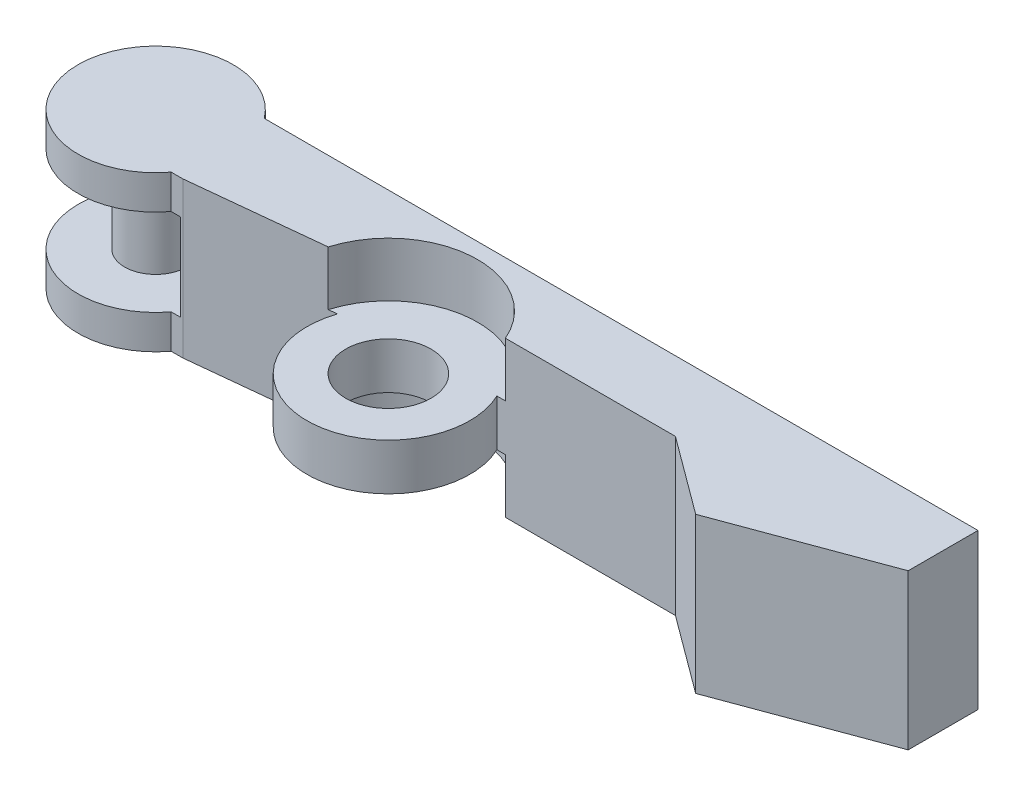
ISO-10303-21;
HEADER;
FILE_DESCRIPTION(('STEP AP214'),'2;1');
FILE_NAME('part.step','',(''),(''),'','','');
FILE_SCHEMA(('AUTOMOTIVE_DESIGN { 1 0 10303 214 1 1 1 1 }'));
ENDSEC;
DATA;
#1=APPLICATION_CONTEXT('core data for automotive mechanical design processes');
#2=APPLICATION_PROTOCOL_DEFINITION('international standard','automotive_design',2000,#1);
#3=PRODUCT_CONTEXT('',#1,'mechanical');
#4=PRODUCT('Part','Part','',(#3));
#5=PRODUCT_RELATED_PRODUCT_CATEGORY('part','',(#4));
#6=PRODUCT_DEFINITION_FORMATION('','',#4);
#7=PRODUCT_DEFINITION_CONTEXT('part definition',#1,'design');
#8=PRODUCT_DEFINITION('design','',#6,#7);
#9=PRODUCT_DEFINITION_SHAPE('','',#8);
#10=(LENGTH_UNIT() NAMED_UNIT(*) SI_UNIT(.MILLI.,.METRE.));
#11=(NAMED_UNIT(*) PLANE_ANGLE_UNIT() SI_UNIT($,.RADIAN.));
#12=(NAMED_UNIT(*) SI_UNIT($,.STERADIAN.) SOLID_ANGLE_UNIT());
#13=UNCERTAINTY_MEASURE_WITH_UNIT(LENGTH_MEASURE(1.E-05),#10,'distance_accuracy_value','');
#14=(GEOMETRIC_REPRESENTATION_CONTEXT(3) GLOBAL_UNCERTAINTY_ASSIGNED_CONTEXT((#13)) GLOBAL_UNIT_ASSIGNED_CONTEXT((#10,
#11,#12)) REPRESENTATION_CONTEXT('',''));
#15=CARTESIAN_POINT('',(0.,0.,0.));
#16=DIRECTION('',(0.,0.,1.));
#17=DIRECTION('',(1.,0.,0.));
#18=AXIS2_PLACEMENT_3D('',#15,#16,#17);
#19=CARTESIAN_POINT('',(-6.25,5.,3.75));
#20=DIRECTION('',(0.,-1.,0.));
#21=DIRECTION('',(0.,0.,-1.));
#22=AXIS2_PLACEMENT_3D('',#19,#20,#21);
#23=CYLINDRICAL_SURFACE('',#22,2.75);
#24=CARTESIAN_POINT('',(-6.25,1.5,3.75));
#25=DIRECTION('',(0.,1.,0.));
#26=DIRECTION('',(0.,0.,1.));
#27=AXIS2_PLACEMENT_3D('',#24,#25,#26);
#28=CIRCLE('',#27,2.75);
#29=CARTESIAN_POINT('',(-6.25,1.5,6.50000000000001));
#30=VERTEX_POINT('',#29);
#31=EDGE_CURVE('E341',#30,#30,#28,.T.);
#32=ORIENTED_EDGE('',*,*,#31,.T.);
#33=EDGE_LOOP('',(#32));
#34=FACE_BOUND('',#33,.T.);
#35=CARTESIAN_POINT('',(-6.25,-1.5,3.75));
#36=DIRECTION('',(0.,-1.,0.));
#37=DIRECTION('',(0.,0.,-1.));
#38=AXIS2_PLACEMENT_3D('',#35,#36,#37);
#39=CIRCLE('',#38,2.75);
#40=CARTESIAN_POINT('',(-6.25,-1.5,1.00000000000001));
#41=VERTEX_POINT('',#40);
#42=EDGE_CURVE('E387',#41,#41,#39,.T.);
#43=ORIENTED_EDGE('',*,*,#42,.T.);
#44=EDGE_LOOP('',(#43));
#45=FACE_BOUND('',#44,.T.);
#46=ADVANCED_FACE('F107',(#34,#45),#23,.F.);
#47=CARTESIAN_POINT('',(-6.25,5.,3.75));
#48=DIRECTION('',(0.,-1.,0.));
#49=DIRECTION('',(0.,0.,-1.));
#50=AXIS2_PLACEMENT_3D('',#47,#48,#49);
#51=CYLINDRICAL_SURFACE('',#50,5.25);
#52=CARTESIAN_POINT('',(-6.25,-1.5,3.75));
#53=DIRECTION('',(0.,-1.,0.));
#54=DIRECTION('',(0.,0.,-1.));
#55=AXIS2_PLACEMENT_3D('',#52,#53,#54);
#56=CIRCLE('',#55,5.25);
#57=CARTESIAN_POINT('',(-1.50658350974743,-1.5,1.49999999999999));
#58=VERTEX_POINT('',#57);
#59=CARTESIAN_POINT('',(-11.2196543991426,-1.5,2.0573585278971));
#60=VERTEX_POINT('',#59);
#61=EDGE_CURVE('E12',#58,#60,#56,.T.);
#62=ORIENTED_EDGE('',*,*,#61,.F.);
#63=DIRECTION('',(0.,-1.,0.));
#64=VECTOR('',#63,1.);
#65=CARTESIAN_POINT('',(-1.50658350974744,5.,1.49999999999999));
#66=LINE('',#65,#64);
#67=CARTESIAN_POINT('',(-1.50658350974743,1.5,1.49999999999999));
#68=VERTEX_POINT('',#67);
#69=EDGE_CURVE('E296',#68,#58,#66,.T.);
#70=ORIENTED_EDGE('',*,*,#69,.F.);
#71=CARTESIAN_POINT('',(-6.25,1.5,3.75));
#72=DIRECTION('',(0.,1.,0.));
#73=DIRECTION('',(0.,0.,1.));
#74=AXIS2_PLACEMENT_3D('',#71,#72,#73);
#75=CIRCLE('',#74,5.25);
#76=CARTESIAN_POINT('',(-11.2196543991426,1.5,2.0573585278971));
#77=VERTEX_POINT('',#76);
#78=EDGE_CURVE('E298',#77,#68,#75,.T.);
#79=ORIENTED_EDGE('',*,*,#78,.F.);
#80=DIRECTION('',(0.,-1.,0.));
#81=VECTOR('',#80,1.);
#82=CARTESIAN_POINT('',(-11.2196543991426,5.,2.0573585278971));
#83=LINE('',#82,#81);
#84=EDGE_CURVE('E274',#77,#60,#83,.T.);
#85=ORIENTED_EDGE('',*,*,#84,.T.);
#86=EDGE_LOOP('',(#62,#70,#79,#85));
#87=FACE_BOUND('',#86,.T.);
#88=ADVANCED_FACE('F109',(#87),#51,.T.);
#89=CARTESIAN_POINT('',(-25.,5.,0.));
#90=DIRECTION('',(0.,-1.,0.));
#91=DIRECTION('',(0.,0.,-1.));
#92=AXIS2_PLACEMENT_3D('',#89,#90,#91);
#93=CYLINDRICAL_SURFACE('',#92,5.);
#94=CARTESIAN_POINT('',(-25.,-2.8,0.));
#95=DIRECTION('',(0.,1.,0.));
#96=DIRECTION('',(0.,0.,1.));
#97=AXIS2_PLACEMENT_3D('',#94,#95,#96);
#98=CIRCLE('',#97,5.);
#99=CARTESIAN_POINT('',(-21.,-2.8,-3.));
#100=VERTEX_POINT('',#99);
#101=CARTESIAN_POINT('',(-21.,-2.8,3.));
#102=VERTEX_POINT('',#101);
#103=EDGE_CURVE('E130',#100,#102,#98,.T.);
#104=ORIENTED_EDGE('',*,*,#103,.F.);
#105=DIRECTION('',(0.,-1.,0.));
#106=VECTOR('',#105,1.);
#107=CARTESIAN_POINT('',(-21.,5.,-3.));
#108=LINE('',#107,#106);
#109=CARTESIAN_POINT('',(-21.,-5.,-3.));
#110=VERTEX_POINT('',#109);
#111=EDGE_CURVE('E284',#100,#110,#108,.T.);
#112=ORIENTED_EDGE('',*,*,#111,.T.);
#113=CARTESIAN_POINT('',(-25.,-5.,0.));
#114=DIRECTION('',(0.,1.,0.));
#115=DIRECTION('',(0.,0.,1.));
#116=AXIS2_PLACEMENT_3D('',#113,#114,#115);
#117=CIRCLE('',#116,5.);
#118=CARTESIAN_POINT('',(-21.,-5.,3.));
#119=VERTEX_POINT('',#118);
#120=EDGE_CURVE('E266',#110,#119,#117,.T.);
#121=ORIENTED_EDGE('',*,*,#120,.T.);
#122=DIRECTION('',(0.,-1.,0.));
#123=VECTOR('',#122,1.);
#124=CARTESIAN_POINT('',(-21.,5.,3.));
#125=LINE('',#124,#123);
#126=EDGE_CURVE('E280',#102,#119,#125,.T.);
#127=ORIENTED_EDGE('',*,*,#126,.F.);
#128=EDGE_LOOP('',(#104,#112,#121,#127));
#129=FACE_BOUND('',#128,.T.);
#130=ADVANCED_FACE('F406',(#129),#93,.T.);
#131=CARTESIAN_POINT('',(0.,5.,1.49999999999999));
#132=DIRECTION('',(0.,0.,-1.));
#133=DIRECTION('',(-1.,0.,0.));
#134=AXIS2_PLACEMENT_3D('',#131,#132,#133);
#135=PLANE('',#134);
#136=DIRECTION('',(-1.,0.,0.));
#137=VECTOR('',#136,1.);
#138=CARTESIAN_POINT('',(0.,-1.5,1.49999999999999));
#139=LINE('',#138,#137);
#140=CARTESIAN_POINT('',(-0.958497377870821,-1.5,1.49999999999999));
#141=VERTEX_POINT('',#140);
#142=EDGE_CURVE('E241',#141,#58,#139,.T.);
#143=ORIENTED_EDGE('',*,*,#142,.F.);
#144=DIRECTION('',(0.,1.,0.));
#145=VECTOR('',#144,1.);
#146=CARTESIAN_POINT('',(-0.958497377870821,-5.,1.49999999999999));
#147=LINE('',#146,#145);
#148=CARTESIAN_POINT('',(-0.958497377870822,-5.,1.49999999999999));
#149=VERTEX_POINT('',#148);
#150=EDGE_CURVE('E226',#141,#149,#147,.F.);
#151=ORIENTED_EDGE('',*,*,#150,.T.);
#152=DIRECTION('',(1.,0.,0.));
#153=VECTOR('',#152,1.);
#154=CARTESIAN_POINT('',(0.,-5.,1.49999999999999));
#155=LINE('',#154,#153);
#156=CARTESIAN_POINT('',(10.,-5.,1.49999999999999));
#157=VERTEX_POINT('',#156);
#158=EDGE_CURVE('E238',#149,#157,#155,.T.);
#159=ORIENTED_EDGE('',*,*,#158,.T.);
#160=DIRECTION('',(0.,-1.,0.));
#161=VECTOR('',#160,1.);
#162=CARTESIAN_POINT('',(10.,5.,1.49999999999999));
#163=LINE('',#162,#161);
#164=CARTESIAN_POINT('',(10.,5.,1.49999999999999));
#165=VERTEX_POINT('',#164);
#166=EDGE_CURVE('E294',#165,#157,#163,.T.);
#167=ORIENTED_EDGE('',*,*,#166,.F.);
#168=DIRECTION('',(1.,0.,0.));
#169=VECTOR('',#168,1.);
#170=CARTESIAN_POINT('',(0.,5.,1.49999999999999));
#171=LINE('',#170,#169);
#172=CARTESIAN_POINT('',(-0.958497377870822,5.,1.49999999999999));
#173=VERTEX_POINT('',#172);
#174=EDGE_CURVE('E273',#173,#165,#171,.T.);
#175=ORIENTED_EDGE('',*,*,#174,.F.);
#176=DIRECTION('',(0.,-1.,0.));
#177=VECTOR('',#176,1.);
#178=CARTESIAN_POINT('',(-0.958497377870821,5.,1.49999999999999));
#179=LINE('',#178,#177);
#180=CARTESIAN_POINT('',(-0.958497377870821,1.5,1.49999999999999));
#181=VERTEX_POINT('',#180);
#182=EDGE_CURVE('E249',#181,#173,#179,.F.);
#183=ORIENTED_EDGE('',*,*,#182,.F.);
#184=DIRECTION('',(1.,0.,0.));
#185=VECTOR('',#184,1.);
#186=CARTESIAN_POINT('',(0.,1.5,1.49999999999999));
#187=LINE('',#186,#185);
#188=EDGE_CURVE('E339',#68,#181,#187,.T.);
#189=ORIENTED_EDGE('',*,*,#188,.F.);
#190=ORIENTED_EDGE('',*,*,#69,.T.);
#191=EDGE_LOOP('',(#143,#151,#159,#167,#175,#183,#189,#190));
#192=FACE_BOUND('',#191,.T.);
#193=ADVANCED_FACE('F236',(#192),#135,.F.);
#194=CARTESIAN_POINT('',(0.0915080643471655,5.,0.876631753191315));
#195=DIRECTION('',(-0.103821868182723,0.,-0.994595907736931));
#196=DIRECTION('',(-0.994595907736931,0.,0.103821868182723));
#197=AXIS2_PLACEMENT_3D('',#194,#195,#196);
#198=PLANE('',#197);
#199=DIRECTION('',(0.994595907736931,0.,-0.103821868182723));
#200=VECTOR('',#199,1.);
#201=CARTESIAN_POINT('',(0.0915080643471655,-5.,0.876631753191315));
#202=LINE('',#201,#200);
#203=CARTESIAN_POINT('',(-20.25,-5.,3.));
#204=VERTEX_POINT('',#203);
#205=CARTESIAN_POINT('',(-11.7623526925942,-5.,2.11400862091219));
#206=VERTEX_POINT('',#205);
#207=EDGE_CURVE('E271',#204,#206,#202,.T.);
#208=ORIENTED_EDGE('',*,*,#207,.T.);
#209=DIRECTION('',(0.,1.,0.));
#210=VECTOR('',#209,1.);
#211=CARTESIAN_POINT('',(-11.7623526925942,-5.,2.11400862091219));
#212=LINE('',#211,#210);
#213=CARTESIAN_POINT('',(-11.7623526925942,-1.5,2.11400862091219));
#214=VERTEX_POINT('',#213);
#215=EDGE_CURVE('E122',#206,#214,#212,.T.);
#216=ORIENTED_EDGE('',*,*,#215,.T.);
#217=DIRECTION('',(-0.994595907736931,0.,0.103821868182723));
#218=VECTOR('',#217,1.);
#219=CARTESIAN_POINT('',(0.0915080643471655,-1.5,0.876631753191315));
#220=LINE('',#219,#218);
#221=EDGE_CURVE('E242',#60,#214,#220,.T.);
#222=ORIENTED_EDGE('',*,*,#221,.F.);
#223=ORIENTED_EDGE('',*,*,#84,.F.);
#224=DIRECTION('',(0.994595907736931,0.,-0.103821868182723));
#225=VECTOR('',#224,1.);
#226=CARTESIAN_POINT('',(0.0915080643471655,1.5,0.876631753191315));
#227=LINE('',#226,#225);
#228=CARTESIAN_POINT('',(-11.7623526925942,1.5,2.11400862091219));
#229=VERTEX_POINT('',#228);
#230=EDGE_CURVE('E335',#229,#77,#227,.T.);
#231=ORIENTED_EDGE('',*,*,#230,.F.);
#232=DIRECTION('',(0.,-1.,0.));
#233=VECTOR('',#232,1.);
#234=CARTESIAN_POINT('',(-11.7623526925942,5.,2.11400862091219));
#235=LINE('',#234,#233);
#236=CARTESIAN_POINT('',(-11.7623526925942,5.,2.11400862091219));
#237=VERTEX_POINT('',#236);
#238=EDGE_CURVE('E253',#237,#229,#235,.T.);
#239=ORIENTED_EDGE('',*,*,#238,.F.);
#240=DIRECTION('',(0.994595907736931,0.,-0.103821868182723));
#241=VECTOR('',#240,1.);
#242=CARTESIAN_POINT('',(0.0915080643471655,5.,0.876631753191315));
#243=LINE('',#242,#241);
#244=CARTESIAN_POINT('',(-20.25,5.,3.));
#245=VERTEX_POINT('',#244);
#246=EDGE_CURVE('E256',#245,#237,#243,.T.);
#247=ORIENTED_EDGE('',*,*,#246,.F.);
#248=DIRECTION('',(0.,-1.,0.));
#249=VECTOR('',#248,1.);
#250=CARTESIAN_POINT('',(-20.25,5.,3.));
#251=LINE('',#250,#249);
#252=EDGE_CURVE('E277',#245,#204,#251,.T.);
#253=ORIENTED_EDGE('',*,*,#252,.T.);
#254=EDGE_LOOP('',(#208,#216,#222,#223,#231,#239,#247,#253));
#255=FACE_BOUND('',#254,.T.);
#256=ADVANCED_FACE('F369',(#255),#198,.F.);
#257=CARTESIAN_POINT('',(2.81604566762027,5.,-3.80991704684196));
#258=DIRECTION('',(-0.594393794424638,0.,0.804174121163744));
#259=DIRECTION('',(0.804174121163744,0.,0.594393794424638));
#260=AXIS2_PLACEMENT_3D('',#257,#258,#259);
#261=PLANE('',#260);
#262=DIRECTION('',(-0.804174121163744,0.,-0.594393794424639));
#263=VECTOR('',#262,1.);
#264=CARTESIAN_POINT('',(2.81604566762027,-5.,-3.80991704684196));
#265=LINE('',#264,#263);
#266=CARTESIAN_POINT('',(15.,-5.,5.19567845309715));
#267=VERTEX_POINT('',#266);
#268=EDGE_CURVE('E248',#267,#157,#265,.T.);
#269=ORIENTED_EDGE('',*,*,#268,.F.);
#270=DIRECTION('',(0.,-1.,0.));
#271=VECTOR('',#270,1.);
#272=CARTESIAN_POINT('',(15.,5.,5.19567845309715));
#273=LINE('',#272,#271);
#274=CARTESIAN_POINT('',(15.,5.,5.19567845309715));
#275=VERTEX_POINT('',#274);
#276=EDGE_CURVE('E292',#275,#267,#273,.T.);
#277=ORIENTED_EDGE('',*,*,#276,.F.);
#278=DIRECTION('',(-0.804174121163744,0.,-0.594393794424639));
#279=VECTOR('',#278,1.);
#280=CARTESIAN_POINT('',(2.81604566762027,5.,-3.80991704684196));
#281=LINE('',#280,#279);
#282=EDGE_CURVE('E346',#275,#165,#281,.T.);
#283=ORIENTED_EDGE('',*,*,#282,.T.);
#284=ORIENTED_EDGE('',*,*,#166,.T.);
#285=EDGE_LOOP('',(#269,#277,#283,#284));
#286=FACE_BOUND('',#285,.T.);
#287=ADVANCED_FACE('F432',(#286),#261,.T.);
#288=CARTESIAN_POINT('',(3.49193211678642,5.,9.44869030437433));
#289=DIRECTION('',(0.346652309635126,0.,0.937993697326711));
#290=DIRECTION('',(0.937993697326711,0.,-0.346652309635126));
#291=AXIS2_PLACEMENT_3D('',#288,#289,#290);
#292=PLANE('',#291);
#293=DIRECTION('',(-0.937993697326711,0.,0.346652309635126));
#294=VECTOR('',#293,1.);
#295=CARTESIAN_POINT('',(3.49193211678642,-5.,9.44869030437433));
#296=LINE('',#295,#294);
#297=CARTESIAN_POINT('',(25.,-5.,1.49999999999999));
#298=VERTEX_POINT('',#297);
#299=EDGE_CURVE('E251',#298,#267,#296,.T.);
#300=ORIENTED_EDGE('',*,*,#299,.F.);
#301=DIRECTION('',(0.,-1.,0.));
#302=VECTOR('',#301,1.);
#303=CARTESIAN_POINT('',(25.,5.,1.49999999999999));
#304=LINE('',#303,#302);
#305=CARTESIAN_POINT('',(25.,5.,1.49999999999999));
#306=VERTEX_POINT('',#305);
#307=EDGE_CURVE('E290',#306,#298,#304,.T.);
#308=ORIENTED_EDGE('',*,*,#307,.F.);
#309=DIRECTION('',(-0.937993697326711,0.,0.346652309635126));
#310=VECTOR('',#309,1.);
#311=CARTESIAN_POINT('',(3.49193211678642,5.,9.44869030437433));
#312=LINE('',#311,#310);
#313=EDGE_CURVE('E349',#306,#275,#312,.T.);
#314=ORIENTED_EDGE('',*,*,#313,.T.);
#315=ORIENTED_EDGE('',*,*,#276,.T.);
#316=EDGE_LOOP('',(#300,#308,#314,#315));
#317=FACE_BOUND('',#316,.T.);
#318=ADVANCED_FACE('F435',(#317),#292,.T.);
#319=CARTESIAN_POINT('',(25.,5.,0.));
#320=DIRECTION('',(1.,0.,0.));
#321=DIRECTION('',(0.,0.,-1.));
#322=AXIS2_PLACEMENT_3D('',#319,#320,#321);
#323=PLANE('',#322);
#324=DIRECTION('',(0.,0.,1.));
#325=VECTOR('',#324,1.);
#326=CARTESIAN_POINT('',(25.,-5.,0.));
#327=LINE('',#326,#325);
#328=CARTESIAN_POINT('',(25.,-5.,-3.00000000000001));
#329=VERTEX_POINT('',#328);
#330=EDGE_CURVE('E260',#329,#298,#327,.T.);
#331=ORIENTED_EDGE('',*,*,#330,.F.);
#332=DIRECTION('',(0.,-1.,0.));
#333=VECTOR('',#332,1.);
#334=CARTESIAN_POINT('',(25.,5.,-3.00000000000001));
#335=LINE('',#334,#333);
#336=CARTESIAN_POINT('',(25.,5.,-3.00000000000001));
#337=VERTEX_POINT('',#336);
#338=EDGE_CURVE('E288',#337,#329,#335,.T.);
#339=ORIENTED_EDGE('',*,*,#338,.F.);
#340=DIRECTION('',(0.,0.,1.));
#341=VECTOR('',#340,1.);
#342=CARTESIAN_POINT('',(25.,5.,0.));
#343=LINE('',#342,#341);
#344=EDGE_CURVE('E352',#337,#306,#343,.T.);
#345=ORIENTED_EDGE('',*,*,#344,.T.);
#346=ORIENTED_EDGE('',*,*,#307,.T.);
#347=EDGE_LOOP('',(#331,#339,#345,#346));
#348=FACE_BOUND('',#347,.T.);
#349=ADVANCED_FACE('F439',(#348),#323,.T.);
#350=CARTESIAN_POINT('',(0.,5.,-3.));
#351=DIRECTION('',(0.,0.,-1.));
#352=DIRECTION('',(-1.,0.,0.));
#353=AXIS2_PLACEMENT_3D('',#350,#351,#352);
#354=PLANE('',#353);
#355=DIRECTION('',(1.,0.,0.));
#356=VECTOR('',#355,1.);
#357=CARTESIAN_POINT('',(0.,2.8,-3.));
#358=LINE('',#357,#356);
#359=CARTESIAN_POINT('',(-21.,2.8,-3.));
#360=VERTEX_POINT('',#359);
#361=CARTESIAN_POINT('',(-20.3902277713536,2.8,-3.));
#362=VERTEX_POINT('',#361);
#363=EDGE_CURVE('E320',#360,#362,#358,.T.);
#364=ORIENTED_EDGE('',*,*,#363,.F.);
#365=CARTESIAN_POINT('',(-21.,5.,-3.));
#366=VERTEX_POINT('',#365);
#367=EDGE_CURVE('E285',#366,#360,#108,.T.);
#368=ORIENTED_EDGE('',*,*,#367,.F.);
#369=DIRECTION('',(1.,0.,0.));
#370=VECTOR('',#369,1.);
#371=CARTESIAN_POINT('',(0.,5.,-3.));
#372=LINE('',#371,#370);
#373=EDGE_CURVE('E355',#366,#337,#372,.T.);
#374=ORIENTED_EDGE('',*,*,#373,.T.);
#375=ORIENTED_EDGE('',*,*,#338,.T.);
#376=DIRECTION('',(1.,0.,0.));
#377=VECTOR('',#376,1.);
#378=CARTESIAN_POINT('',(0.,-5.,-3.));
#379=LINE('',#378,#377);
#380=EDGE_CURVE('E263',#110,#329,#379,.T.);
#381=ORIENTED_EDGE('',*,*,#380,.F.);
#382=ORIENTED_EDGE('',*,*,#111,.F.);
#383=DIRECTION('',(1.,0.,0.));
#384=VECTOR('',#383,1.);
#385=CARTESIAN_POINT('',(0.,-2.8,-3.));
#386=LINE('',#385,#384);
#387=CARTESIAN_POINT('',(-20.3902277713536,-2.8,-3.));
#388=VERTEX_POINT('',#387);
#389=EDGE_CURVE('E326',#100,#388,#386,.T.);
#390=ORIENTED_EDGE('',*,*,#389,.T.);
#391=DIRECTION('',(0.,-1.,0.));
#392=VECTOR('',#391,1.);
#393=CARTESIAN_POINT('',(-20.3902277713536,2.8,-3.));
#394=LINE('',#393,#392);
#395=EDGE_CURVE('E323',#388,#362,#394,.F.);
#396=ORIENTED_EDGE('',*,*,#395,.T.);
#397=EDGE_LOOP('',(#364,#368,#374,#375,#381,#382,#390,#396));
#398=FACE_BOUND('',#397,.T.);
#399=ADVANCED_FACE('F400',(#398),#354,.T.);
#400=ORIENTED_EDGE('',*,*,#367,.T.);
#401=CARTESIAN_POINT('',(-25.,2.8,0.));
#402=DIRECTION('',(0.,1.,0.));
#403=DIRECTION('',(0.,0.,1.));
#404=AXIS2_PLACEMENT_3D('',#401,#402,#403);
#405=CIRCLE('',#404,5.);
#406=CARTESIAN_POINT('',(-21.,2.8,3.));
#407=VERTEX_POINT('',#406);
#408=EDGE_CURVE('E313',#360,#407,#405,.T.);
#409=ORIENTED_EDGE('',*,*,#408,.T.);
#410=CARTESIAN_POINT('',(-21.,5.,3.));
#411=VERTEX_POINT('',#410);
#412=EDGE_CURVE('E281',#411,#407,#125,.T.);
#413=ORIENTED_EDGE('',*,*,#412,.F.);
#414=CARTESIAN_POINT('',(-25.,5.,0.));
#415=DIRECTION('',(0.,1.,0.));
#416=DIRECTION('',(0.,0.,1.));
#417=AXIS2_PLACEMENT_3D('',#414,#415,#416);
#418=CIRCLE('',#417,5.);
#419=EDGE_CURVE('E358',#366,#411,#418,.T.);
#420=ORIENTED_EDGE('',*,*,#419,.F.);
#421=EDGE_LOOP('',(#400,#409,#413,#420));
#422=FACE_BOUND('',#421,.T.);
#423=ADVANCED_FACE('F318',(#422),#93,.T.);
#424=CARTESIAN_POINT('',(0.,5.,2.99999999999999));
#425=DIRECTION('',(0.,0.,-1.));
#426=DIRECTION('',(-1.,0.,0.));
#427=AXIS2_PLACEMENT_3D('',#424,#425,#426);
#428=PLANE('',#427);
#429=ORIENTED_EDGE('',*,*,#412,.T.);
#430=DIRECTION('',(1.,0.,0.));
#431=VECTOR('',#430,1.);
#432=CARTESIAN_POINT('',(0.,2.8,2.99999999999999));
#433=LINE('',#432,#431);
#434=CARTESIAN_POINT('',(-20.3902277713536,2.8,3.));
#435=VERTEX_POINT('',#434);
#436=EDGE_CURVE('E115',#407,#435,#433,.T.);
#437=ORIENTED_EDGE('',*,*,#436,.T.);
#438=DIRECTION('',(0.,-1.,0.));
#439=VECTOR('',#438,1.);
#440=CARTESIAN_POINT('',(-20.3902277713536,2.8,3.));
#441=LINE('',#440,#439);
#442=CARTESIAN_POINT('',(-20.3902277713536,-2.8,3.));
#443=VERTEX_POINT('',#442);
#444=EDGE_CURVE('E302',#443,#435,#441,.F.);
#445=ORIENTED_EDGE('',*,*,#444,.F.);
#446=DIRECTION('',(1.,0.,0.));
#447=VECTOR('',#446,1.);
#448=CARTESIAN_POINT('',(0.,-2.8,2.99999999999999));
#449=LINE('',#448,#447);
#450=EDGE_CURVE('E300',#102,#443,#449,.T.);
#451=ORIENTED_EDGE('',*,*,#450,.F.);
#452=ORIENTED_EDGE('',*,*,#126,.T.);
#453=DIRECTION('',(1.,0.,0.));
#454=VECTOR('',#453,1.);
#455=CARTESIAN_POINT('',(0.,-5.,2.99999999999999));
#456=LINE('',#455,#454);
#457=EDGE_CURVE('E269',#119,#204,#456,.T.);
#458=ORIENTED_EDGE('',*,*,#457,.T.);
#459=ORIENTED_EDGE('',*,*,#252,.F.);
#460=DIRECTION('',(1.,0.,0.));
#461=VECTOR('',#460,1.);
#462=CARTESIAN_POINT('',(0.,5.,2.99999999999999));
#463=LINE('',#462,#461);
#464=EDGE_CURVE('E359',#411,#245,#463,.T.);
#465=ORIENTED_EDGE('',*,*,#464,.F.);
#466=EDGE_LOOP('',(#429,#437,#445,#451,#452,#458,#459,#465));
#467=FACE_BOUND('',#466,.T.);
#468=ADVANCED_FACE('F306',(#467),#428,.F.);
#469=CARTESIAN_POINT('',(0.,-5.,0.));
#470=DIRECTION('',(0.,1.,0.));
#471=DIRECTION('',(0.,0.,1.));
#472=AXIS2_PLACEMENT_3D('',#469,#470,#471);
#473=PLANE('',#472);
#474=ORIENTED_EDGE('',*,*,#158,.F.);
#475=CARTESIAN_POINT('',(-6.25,-5.,3.75));
#476=DIRECTION('',(0.,1.,0.));
#477=DIRECTION('',(0.,0.,1.));
#478=AXIS2_PLACEMENT_3D('',#475,#476,#477);
#479=CIRCLE('',#478,5.75);
#480=EDGE_CURVE('E223',#149,#206,#479,.T.);
#481=ORIENTED_EDGE('',*,*,#480,.T.);
#482=ORIENTED_EDGE('',*,*,#207,.F.);
#483=ORIENTED_EDGE('',*,*,#457,.F.);
#484=ORIENTED_EDGE('',*,*,#120,.F.);
#485=ORIENTED_EDGE('',*,*,#380,.T.);
#486=ORIENTED_EDGE('',*,*,#330,.T.);
#487=ORIENTED_EDGE('',*,*,#299,.T.);
#488=ORIENTED_EDGE('',*,*,#268,.T.);
#489=EDGE_LOOP('',(#474,#481,#482,#483,#484,#485,#486,#487,#488));
#490=FACE_BOUND('',#489,.T.);
#491=ADVANCED_FACE('F245',(#490),#473,.F.);
#492=CARTESIAN_POINT('',(0.,5.,0.));
#493=DIRECTION('',(0.,1.,0.));
#494=DIRECTION('',(0.,0.,1.));
#495=AXIS2_PLACEMENT_3D('',#492,#493,#494);
#496=PLANE('',#495);
#497=ORIENTED_EDGE('',*,*,#246,.T.);
#498=CARTESIAN_POINT('',(-6.25,5.,3.75));
#499=DIRECTION('',(0.,1.,0.));
#500=DIRECTION('',(0.,0.,1.));
#501=AXIS2_PLACEMENT_3D('',#498,#499,#500);
#502=CIRCLE('',#501,5.75);
#503=EDGE_CURVE('E333',#173,#237,#502,.T.);
#504=ORIENTED_EDGE('',*,*,#503,.F.);
#505=ORIENTED_EDGE('',*,*,#174,.T.);
#506=ORIENTED_EDGE('',*,*,#282,.F.);
#507=ORIENTED_EDGE('',*,*,#313,.F.);
#508=ORIENTED_EDGE('',*,*,#344,.F.);
#509=ORIENTED_EDGE('',*,*,#373,.F.);
#510=ORIENTED_EDGE('',*,*,#419,.T.);
#511=ORIENTED_EDGE('',*,*,#464,.T.);
#512=EDGE_LOOP('',(#497,#504,#505,#506,#507,#508,#509,#510,#511));
#513=FACE_BOUND('',#512,.T.);
#514=ADVANCED_FACE('F365',(#513),#496,.T.);
#515=CARTESIAN_POINT('',(-6.25,5.,3.75));
#516=DIRECTION('',(0.,-1.,0.));
#517=DIRECTION('',(0.,0.,-1.));
#518=AXIS2_PLACEMENT_3D('',#515,#516,#517);
#519=CYLINDRICAL_SURFACE('',#518,5.75);
#520=ORIENTED_EDGE('',*,*,#182,.T.);
#521=ORIENTED_EDGE('',*,*,#503,.T.);
#522=ORIENTED_EDGE('',*,*,#238,.T.);
#523=CARTESIAN_POINT('',(-6.25,1.5,3.75));
#524=DIRECTION('',(0.,1.,0.));
#525=DIRECTION('',(0.,0.,1.));
#526=AXIS2_PLACEMENT_3D('',#523,#524,#525);
#527=CIRCLE('',#526,5.75);
#528=EDGE_CURVE('E332',#181,#229,#527,.T.);
#529=ORIENTED_EDGE('',*,*,#528,.F.);
#530=EDGE_LOOP('',(#520,#521,#522,#529));
#531=FACE_BOUND('',#530,.T.);
#532=ADVANCED_FACE('F374',(#531),#519,.F.);
#533=CARTESIAN_POINT('',(-6.25,1.5,3.75));
#534=DIRECTION('',(0.,1.,0.));
#535=DIRECTION('',(0.,0.,1.));
#536=AXIS2_PLACEMENT_3D('',#533,#534,#535);
#537=PLANE('',#536);
#538=ORIENTED_EDGE('',*,*,#31,.F.);
#539=EDGE_LOOP('',(#538));
#540=FACE_BOUND('',#539,.T.);
#541=ORIENTED_EDGE('',*,*,#188,.T.);
#542=ORIENTED_EDGE('',*,*,#528,.T.);
#543=ORIENTED_EDGE('',*,*,#230,.T.);
#544=ORIENTED_EDGE('',*,*,#78,.T.);
#545=EDGE_LOOP('',(#541,#542,#543,#544));
#546=FACE_BOUND('',#545,.T.);
#547=ADVANCED_FACE('F377',(#540,#546),#537,.T.);
#548=CARTESIAN_POINT('',(-25.,2.8,0.));
#549=DIRECTION('',(0.,-1.,0.));
#550=DIRECTION('',(0.,0.,-1.));
#551=AXIS2_PLACEMENT_3D('',#548,#549,#550);
#552=CYLINDRICAL_SURFACE('',#551,5.50000000000001);
#553=CARTESIAN_POINT('',(-25.,-2.8,0.));
#554=DIRECTION('',(0.,1.,0.));
#555=DIRECTION('',(0.,0.,1.));
#556=AXIS2_PLACEMENT_3D('',#553,#554,#555);
#557=CIRCLE('',#556,5.50000000000001);
#558=EDGE_CURVE('E393',#443,#388,#557,.T.);
#559=ORIENTED_EDGE('',*,*,#558,.F.);
#560=ORIENTED_EDGE('',*,*,#444,.T.);
#561=CARTESIAN_POINT('',(-25.,2.8,0.));
#562=DIRECTION('',(0.,1.,0.));
#563=DIRECTION('',(0.,0.,1.));
#564=AXIS2_PLACEMENT_3D('',#561,#562,#563);
#565=CIRCLE('',#564,5.50000000000001);
#566=EDGE_CURVE('E316',#435,#362,#565,.T.);
#567=ORIENTED_EDGE('',*,*,#566,.T.);
#568=ORIENTED_EDGE('',*,*,#395,.F.);
#569=EDGE_LOOP('',(#559,#560,#567,#568));
#570=FACE_BOUND('',#569,.T.);
#571=ADVANCED_FACE('F410',(#570),#552,.F.);
#572=CARTESIAN_POINT('',(-25.,2.8,0.));
#573=DIRECTION('',(0.,1.,0.));
#574=DIRECTION('',(0.,0.,1.));
#575=AXIS2_PLACEMENT_3D('',#572,#573,#574);
#576=PLANE('',#575);
#577=CARTESIAN_POINT('',(-25.,2.8,0.));
#578=DIRECTION('',(0.,1.,0.));
#579=DIRECTION('',(0.,0.,1.));
#580=AXIS2_PLACEMENT_3D('',#577,#578,#579);
#581=CIRCLE('',#580,2.);
#582=CARTESIAN_POINT('',(-25.,2.8,2.));
#583=VERTEX_POINT('',#582);
#584=EDGE_CURVE('E582',#583,#583,#581,.T.);
#585=ORIENTED_EDGE('',*,*,#584,.T.);
#586=EDGE_LOOP('',(#585));
#587=FACE_BOUND('',#586,.T.);
#588=ORIENTED_EDGE('',*,*,#363,.T.);
#589=ORIENTED_EDGE('',*,*,#566,.F.);
#590=ORIENTED_EDGE('',*,*,#436,.F.);
#591=ORIENTED_EDGE('',*,*,#408,.F.);
#592=EDGE_LOOP('',(#588,#589,#590,#591));
#593=FACE_BOUND('',#592,.T.);
#594=ADVANCED_FACE('F312',(#587,#593),#576,.F.);
#595=CARTESIAN_POINT('',(-25.,-2.8,0.));
#596=DIRECTION('',(0.,1.,0.));
#597=DIRECTION('',(0.,0.,1.));
#598=AXIS2_PLACEMENT_3D('',#595,#596,#597);
#599=PLANE('',#598);
#600=CARTESIAN_POINT('',(-25.,-2.8,0.));
#601=DIRECTION('',(0.,1.,0.));
#602=DIRECTION('',(0.,0.,1.));
#603=AXIS2_PLACEMENT_3D('',#600,#601,#602);
#604=CIRCLE('',#603,2.);
#605=CARTESIAN_POINT('',(-25.,-2.8,2.));
#606=VERTEX_POINT('',#605);
#607=EDGE_CURVE('E321',#606,#606,#604,.T.);
#608=ORIENTED_EDGE('',*,*,#607,.F.);
#609=EDGE_LOOP('',(#608));
#610=FACE_BOUND('',#609,.T.);
#611=ORIENTED_EDGE('',*,*,#103,.T.);
#612=ORIENTED_EDGE('',*,*,#450,.T.);
#613=ORIENTED_EDGE('',*,*,#558,.T.);
#614=ORIENTED_EDGE('',*,*,#389,.F.);
#615=EDGE_LOOP('',(#611,#612,#613,#614));
#616=FACE_BOUND('',#615,.T.);
#617=ADVANCED_FACE('F402',(#610,#616),#599,.T.);
#618=CARTESIAN_POINT('',(-6.25,-1.5,3.75));
#619=DIRECTION('',(0.,-1.,0.));
#620=DIRECTION('',(0.,0.,1.));
#621=AXIS2_PLACEMENT_3D('',#618,#619,#620);
#622=PLANE('',#621);
#623=ORIENTED_EDGE('',*,*,#42,.F.);
#624=EDGE_LOOP('',(#623));
#625=FACE_BOUND('',#624,.T.);
#626=ORIENTED_EDGE('',*,*,#142,.T.);
#627=ORIENTED_EDGE('',*,*,#61,.T.);
#628=ORIENTED_EDGE('',*,*,#221,.T.);
#629=CARTESIAN_POINT('',(-6.25,-1.5,3.75));
#630=DIRECTION('',(0.,1.,0.));
#631=DIRECTION('',(0.,0.,1.));
#632=AXIS2_PLACEMENT_3D('',#629,#630,#631);
#633=CIRCLE('',#632,5.75);
#634=EDGE_CURVE('E232',#141,#214,#633,.T.);
#635=ORIENTED_EDGE('',*,*,#634,.F.);
#636=EDGE_LOOP('',(#626,#627,#628,#635));
#637=FACE_BOUND('',#636,.T.);
#638=ADVANCED_FACE('F385',(#625,#637),#622,.T.);
#639=CARTESIAN_POINT('',(-6.25,-5.,3.75));
#640=DIRECTION('',(0.,1.,0.));
#641=DIRECTION('',(0.,0.,1.));
#642=AXIS2_PLACEMENT_3D('',#639,#640,#641);
#643=CYLINDRICAL_SURFACE('',#642,5.75);
#644=ORIENTED_EDGE('',*,*,#634,.T.);
#645=ORIENTED_EDGE('',*,*,#215,.F.);
#646=ORIENTED_EDGE('',*,*,#480,.F.);
#647=ORIENTED_EDGE('',*,*,#150,.F.);
#648=EDGE_LOOP('',(#644,#645,#646,#647));
#649=FACE_BOUND('',#648,.T.);
#650=ADVANCED_FACE('F225',(#649),#643,.F.);
#651=CARTESIAN_POINT('',(-25.,-10.6568542494924,0.));
#652=DIRECTION('',(0.,1.,0.));
#653=DIRECTION('',(0.,0.,1.));
#654=AXIS2_PLACEMENT_3D('',#651,#652,#653);
#655=CYLINDRICAL_SURFACE('',#654,2.);
#656=ORIENTED_EDGE('',*,*,#607,.T.);
#657=EDGE_LOOP('',(#656));
#658=FACE_BOUND('',#657,.T.);
#659=ORIENTED_EDGE('',*,*,#584,.F.);
#660=EDGE_LOOP('',(#659));
#661=FACE_BOUND('',#660,.T.);
#662=ADVANCED_FACE('F534',(#658,#661),#655,.T.);
#663=CLOSED_SHELL('',(#46,#88,#130,#193,#256,#287,#318,#349,#399,#423,#468,#491,#514,#532,#547,
#571,#594,#617,#638,#650,#662));
#664=MANIFOLD_SOLID_BREP('B2',#663);
#665=ADVANCED_BREP_SHAPE_REPRESENTATION('',(#18,#664),#14);
#666=SHAPE_DEFINITION_REPRESENTATION(#9,#665);
ENDSEC;
END-ISO-10303-21;
